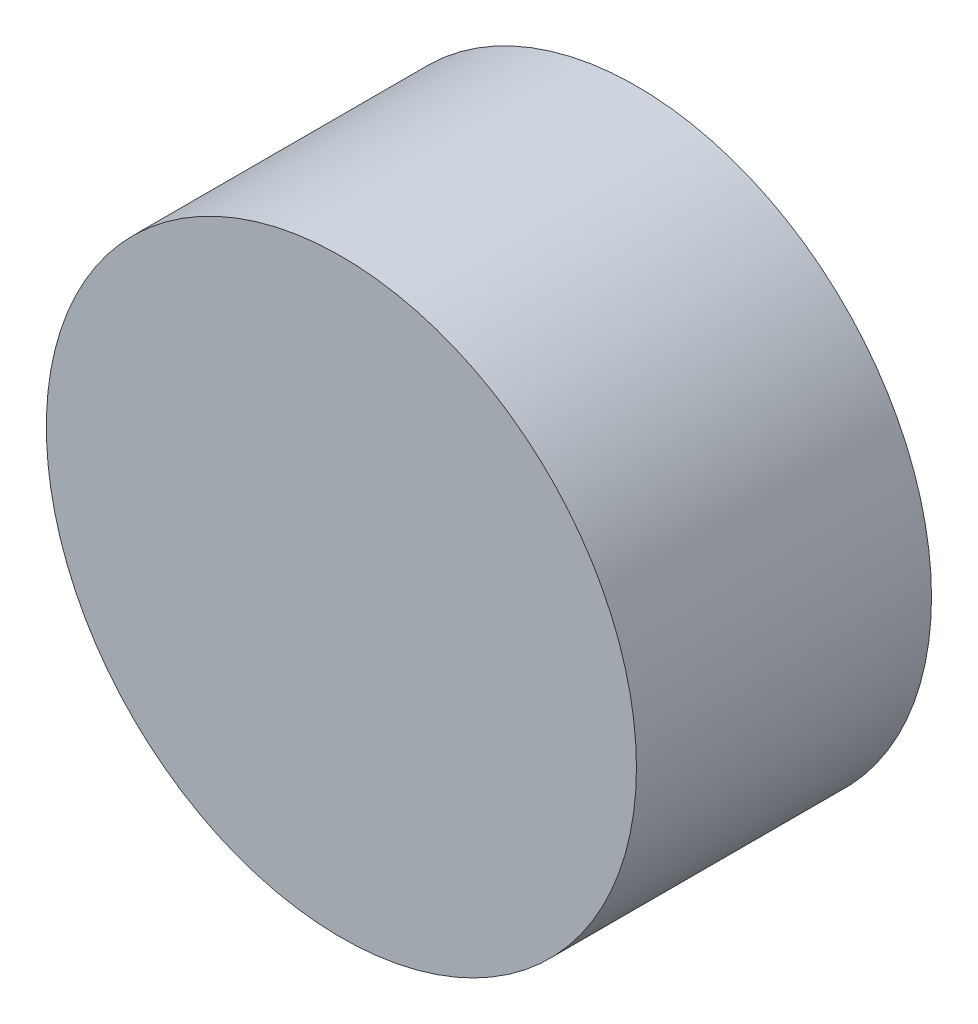
ISO-10303-21;
HEADER;
FILE_DESCRIPTION(('STEP AP214'),'2;1');
FILE_NAME('part.step','',(''),(''),'','','');
FILE_SCHEMA(('AUTOMOTIVE_DESIGN { 1 0 10303 214 1 1 1 1 }'));
ENDSEC;
DATA;
#1=APPLICATION_CONTEXT('core data for automotive mechanical design processes');
#2=APPLICATION_PROTOCOL_DEFINITION('international standard','automotive_design',2000,#1);
#3=PRODUCT_CONTEXT('',#1,'mechanical');
#4=PRODUCT('Part','Part','',(#3));
#5=PRODUCT_RELATED_PRODUCT_CATEGORY('part','',(#4));
#6=PRODUCT_DEFINITION_FORMATION('','',#4);
#7=PRODUCT_DEFINITION_CONTEXT('part definition',#1,'design');
#8=PRODUCT_DEFINITION('design','',#6,#7);
#9=PRODUCT_DEFINITION_SHAPE('','',#8);
#10=(LENGTH_UNIT() NAMED_UNIT(*) SI_UNIT(.MILLI.,.METRE.));
#11=(NAMED_UNIT(*) PLANE_ANGLE_UNIT() SI_UNIT($,.RADIAN.));
#12=(NAMED_UNIT(*) SI_UNIT($,.STERADIAN.) SOLID_ANGLE_UNIT());
#13=UNCERTAINTY_MEASURE_WITH_UNIT(LENGTH_MEASURE(1.E-05),#10,'distance_accuracy_value','');
#14=(GEOMETRIC_REPRESENTATION_CONTEXT(3) GLOBAL_UNCERTAINTY_ASSIGNED_CONTEXT((#13)) GLOBAL_UNIT_ASSIGNED_CONTEXT((#10,
#11,#12)) REPRESENTATION_CONTEXT('',''));
#15=CARTESIAN_POINT('',(0.,0.,0.));
#16=DIRECTION('',(0.,0.,1.));
#17=DIRECTION('',(1.,0.,0.));
#18=AXIS2_PLACEMENT_3D('',#15,#16,#17);
#19=CARTESIAN_POINT('',(0.,0.,3.175));
#20=DIRECTION('',(0.,0.,-1.));
#21=DIRECTION('',(-1.,0.,0.));
#22=AXIS2_PLACEMENT_3D('',#19,#20,#21);
#23=CYLINDRICAL_SURFACE('',#22,3.175);
#24=CARTESIAN_POINT('',(0.,0.,3.175));
#25=DIRECTION('',(0.,0.,1.));
#26=DIRECTION('',(1.,0.,0.));
#27=AXIS2_PLACEMENT_3D('',#24,#25,#26);
#28=CIRCLE('',#27,3.175);
#29=CARTESIAN_POINT('',(3.175,0.,3.175));
#30=VERTEX_POINT('',#29);
#31=EDGE_CURVE('E10',#30,#30,#28,.T.);
#32=ORIENTED_EDGE('',*,*,#31,.F.);
#33=EDGE_LOOP('',(#32));
#34=FACE_BOUND('',#33,.T.);
#35=CARTESIAN_POINT('',(0.,0.,0.));
#36=DIRECTION('',(0.,0.,1.));
#37=DIRECTION('',(1.,0.,0.));
#38=AXIS2_PLACEMENT_3D('',#35,#36,#37);
#39=CIRCLE('',#38,3.175);
#40=CARTESIAN_POINT('',(3.175,0.,0.));
#41=VERTEX_POINT('',#40);
#42=EDGE_CURVE('E42',#41,#41,#39,.T.);
#43=ORIENTED_EDGE('',*,*,#42,.T.);
#44=EDGE_LOOP('',(#43));
#45=FACE_BOUND('',#44,.T.);
#46=ADVANCED_FACE('F39',(#34,#45),#23,.T.);
#47=CARTESIAN_POINT('',(0.,0.,3.175));
#48=DIRECTION('',(0.,0.,1.));
#49=DIRECTION('',(1.,0.,0.));
#50=AXIS2_PLACEMENT_3D('',#47,#48,#49);
#51=PLANE('',#50);
#52=ORIENTED_EDGE('',*,*,#31,.T.);
#53=EDGE_LOOP('',(#52));
#54=FACE_BOUND('',#53,.T.);
#55=ADVANCED_FACE('F54',(#54),#51,.T.);
#56=CARTESIAN_POINT('',(0.,0.,0.));
#57=DIRECTION('',(0.,0.,1.));
#58=DIRECTION('',(1.,0.,0.));
#59=AXIS2_PLACEMENT_3D('',#56,#57,#58);
#60=PLANE('',#59);
#61=ORIENTED_EDGE('',*,*,#42,.F.);
#62=EDGE_LOOP('',(#61));
#63=FACE_BOUND('',#62,.T.);
#64=ADVANCED_FACE('F52',(#63),#60,.F.);
#65=CLOSED_SHELL('',(#46,#55,#64));
#66=MANIFOLD_SOLID_BREP('B2',#65);
#67=ADVANCED_BREP_SHAPE_REPRESENTATION('',(#18,#66),#14);
#68=SHAPE_DEFINITION_REPRESENTATION(#9,#67);
ENDSEC;
END-ISO-10303-21;
